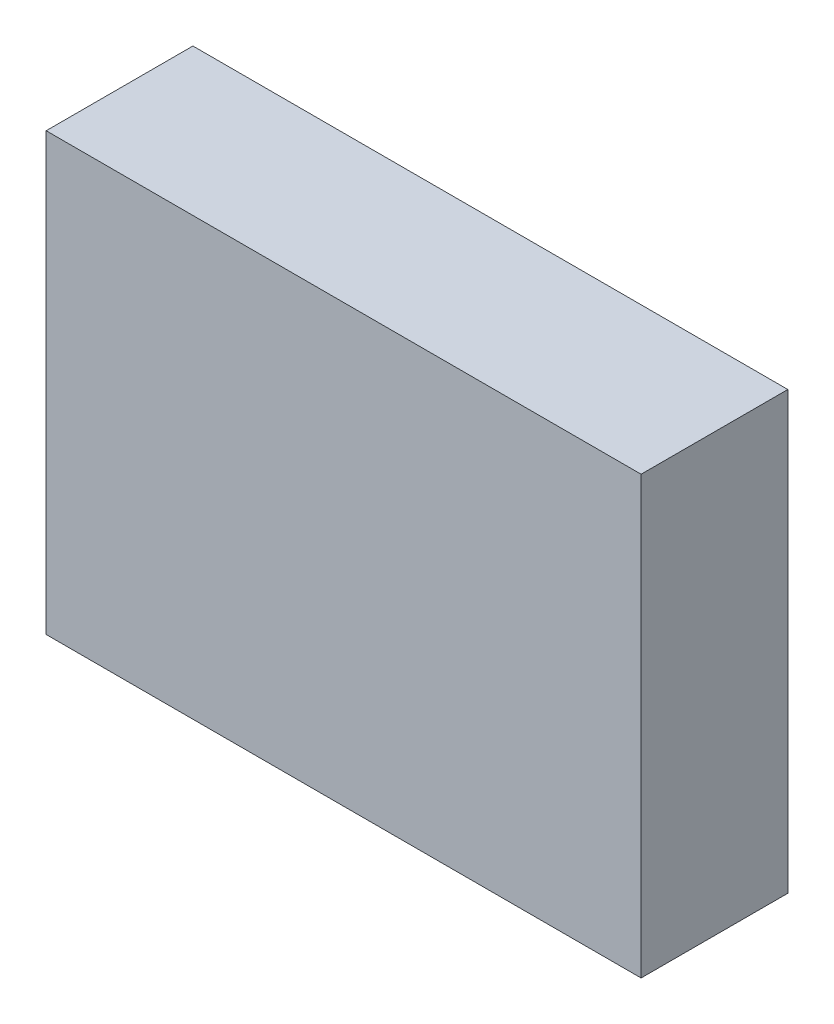
ISO-10303-21;
HEADER;
FILE_DESCRIPTION(('STEP AP214'),'2;1');
FILE_NAME('part.step','',(''),(''),'','','');
FILE_SCHEMA(('AUTOMOTIVE_DESIGN { 1 0 10303 214 1 1 1 1 }'));
ENDSEC;
DATA;
#1=APPLICATION_CONTEXT('core data for automotive mechanical design processes');
#2=APPLICATION_PROTOCOL_DEFINITION('international standard','automotive_design',2000,#1);
#3=PRODUCT_CONTEXT('',#1,'mechanical');
#4=PRODUCT('Part','Part','',(#3));
#5=PRODUCT_RELATED_PRODUCT_CATEGORY('part','',(#4));
#6=PRODUCT_DEFINITION_FORMATION('','',#4);
#7=PRODUCT_DEFINITION_CONTEXT('part definition',#1,'design');
#8=PRODUCT_DEFINITION('design','',#6,#7);
#9=PRODUCT_DEFINITION_SHAPE('','',#8);
#10=(LENGTH_UNIT() NAMED_UNIT(*) SI_UNIT(.MILLI.,.METRE.));
#11=(NAMED_UNIT(*) PLANE_ANGLE_UNIT() SI_UNIT($,.RADIAN.));
#12=(NAMED_UNIT(*) SI_UNIT($,.STERADIAN.) SOLID_ANGLE_UNIT());
#13=UNCERTAINTY_MEASURE_WITH_UNIT(LENGTH_MEASURE(1.E-05),#10,'distance_accuracy_value','');
#14=(GEOMETRIC_REPRESENTATION_CONTEXT(3) GLOBAL_UNCERTAINTY_ASSIGNED_CONTEXT((#13)) GLOBAL_UNIT_ASSIGNED_CONTEXT((#10,
#11,#12)) REPRESENTATION_CONTEXT('',''));
#15=CARTESIAN_POINT('',(0.,0.,0.));
#16=DIRECTION('',(0.,0.,1.));
#17=DIRECTION('',(1.,0.,0.));
#18=AXIS2_PLACEMENT_3D('',#15,#16,#17);
#19=CARTESIAN_POINT('',(0.,1.27000001273E-06,0.36999926));
#20=DIRECTION('',(0.,0.,1.));
#21=DIRECTION('',(1.,0.,0.));
#22=AXIS2_PLACEMENT_3D('',#19,#20,#21);
#23=PLANE('',#22);
#24=DIRECTION('',(0.,1.,0.));
#25=VECTOR('',#24,1.);
#26=CARTESIAN_POINT('',(0.75000104,-0.5499989,0.36999926));
#27=LINE('',#26,#25);
#28=CARTESIAN_POINT('',(0.75000104,-0.5499989,0.36999926));
#29=VERTEX_POINT('',#28);
#30=CARTESIAN_POINT('',(0.75000104,0.55000144,0.36999926));
#31=VERTEX_POINT('',#30);
#32=EDGE_CURVE('E20',#29,#31,#27,.T.);
#33=ORIENTED_EDGE('',*,*,#32,.T.);
#34=DIRECTION('',(-1.,0.,0.));
#35=VECTOR('',#34,1.);
#36=CARTESIAN_POINT('',(0.75000104,0.55000144,0.36999926));
#37=LINE('',#36,#35);
#38=CARTESIAN_POINT('',(-0.75000104,0.55000144,0.36999926));
#39=VERTEX_POINT('',#38);
#40=EDGE_CURVE('E72',#31,#39,#37,.T.);
#41=ORIENTED_EDGE('',*,*,#40,.T.);
#42=DIRECTION('',(0.,-1.,0.));
#43=VECTOR('',#42,1.);
#44=CARTESIAN_POINT('',(-0.75000104,0.55000144,0.36999926));
#45=LINE('',#44,#43);
#46=CARTESIAN_POINT('',(-0.75000104,-0.5499989,0.36999926));
#47=VERTEX_POINT('',#46);
#48=EDGE_CURVE('E108',#39,#47,#45,.T.);
#49=ORIENTED_EDGE('',*,*,#48,.T.);
#50=DIRECTION('',(1.,0.,0.));
#51=VECTOR('',#50,1.);
#52=CARTESIAN_POINT('',(-0.75000104,-0.5499989,0.36999926));
#53=LINE('',#52,#51);
#54=EDGE_CURVE('E11',#47,#29,#53,.T.);
#55=ORIENTED_EDGE('',*,*,#54,.T.);
#56=EDGE_LOOP('',(#33,#41,#49,#55));
#57=FACE_BOUND('',#56,.T.);
#58=ADVANCED_FACE('F16',(#57),#23,.T.);
#59=CARTESIAN_POINT('',(0.,1.27000001273E-06,0.));
#60=DIRECTION('',(0.,0.,1.));
#61=DIRECTION('',(1.,0.,0.));
#62=AXIS2_PLACEMENT_3D('',#59,#60,#61);
#63=PLANE('',#62);
#64=DIRECTION('',(0.,1.,0.));
#65=VECTOR('',#64,1.);
#66=CARTESIAN_POINT('',(0.75000104,-0.5499989,0.));
#67=LINE('',#66,#65);
#68=CARTESIAN_POINT('',(0.75000104,-0.5499989,0.));
#69=VERTEX_POINT('',#68);
#70=CARTESIAN_POINT('',(0.75000104,0.55000144,0.));
#71=VERTEX_POINT('',#70);
#72=EDGE_CURVE('E90',#69,#71,#67,.T.);
#73=ORIENTED_EDGE('',*,*,#72,.F.);
#74=DIRECTION('',(1.,0.,0.));
#75=VECTOR('',#74,1.);
#76=CARTESIAN_POINT('',(-0.75000104,-0.5499989,0.));
#77=LINE('',#76,#75);
#78=CARTESIAN_POINT('',(-0.75000104,-0.5499989,0.));
#79=VERTEX_POINT('',#78);
#80=EDGE_CURVE('E27',#79,#69,#77,.T.);
#81=ORIENTED_EDGE('',*,*,#80,.F.);
#82=DIRECTION('',(0.,-1.,0.));
#83=VECTOR('',#82,1.);
#84=CARTESIAN_POINT('',(-0.75000104,0.55000144,0.));
#85=LINE('',#84,#83);
#86=CARTESIAN_POINT('',(-0.75000104,0.55000144,0.));
#87=VERTEX_POINT('',#86);
#88=EDGE_CURVE('E62',#87,#79,#85,.T.);
#89=ORIENTED_EDGE('',*,*,#88,.F.);
#90=DIRECTION('',(-1.,0.,0.));
#91=VECTOR('',#90,1.);
#92=CARTESIAN_POINT('',(0.75000104,0.55000144,0.));
#93=LINE('',#92,#91);
#94=EDGE_CURVE('E87',#71,#87,#93,.T.);
#95=ORIENTED_EDGE('',*,*,#94,.F.);
#96=EDGE_LOOP('',(#73,#81,#89,#95));
#97=FACE_BOUND('',#96,.T.);
#98=ADVANCED_FACE('F117',(#97),#63,.F.);
#99=CARTESIAN_POINT('',(-0.75000104,-0.5499989,0.));
#100=DIRECTION('',(0.,1.,0.));
#101=DIRECTION('',(1.,0.,0.));
#102=AXIS2_PLACEMENT_3D('',#99,#100,#101);
#103=PLANE('',#102);
#104=DIRECTION('',(0.,0.,1.));
#105=VECTOR('',#104,1.);
#106=CARTESIAN_POINT('',(-0.75000104,-0.5499989,0.));
#107=LINE('',#106,#105);
#108=EDGE_CURVE('E104',#79,#47,#107,.T.);
#109=ORIENTED_EDGE('',*,*,#108,.F.);
#110=ORIENTED_EDGE('',*,*,#80,.T.);
#111=DIRECTION('',(0.,0.,1.));
#112=VECTOR('',#111,1.);
#113=CARTESIAN_POINT('',(0.75000104,-0.5499989,0.));
#114=LINE('',#113,#112);
#115=EDGE_CURVE('E97',#69,#29,#114,.T.);
#116=ORIENTED_EDGE('',*,*,#115,.T.);
#117=ORIENTED_EDGE('',*,*,#54,.F.);
#118=EDGE_LOOP('',(#109,#110,#116,#117));
#119=FACE_BOUND('',#118,.T.);
#120=ADVANCED_FACE('F18',(#119),#103,.F.);
#121=CARTESIAN_POINT('',(-0.75000104,0.55000144,0.));
#122=DIRECTION('',(1.,0.,0.));
#123=DIRECTION('',(0.,1.,0.));
#124=AXIS2_PLACEMENT_3D('',#121,#122,#123);
#125=PLANE('',#124);
#126=DIRECTION('',(0.,0.,1.));
#127=VECTOR('',#126,1.);
#128=CARTESIAN_POINT('',(-0.75000104,0.55000144,0.));
#129=LINE('',#128,#127);
#130=EDGE_CURVE('E79',#87,#39,#129,.T.);
#131=ORIENTED_EDGE('',*,*,#130,.F.);
#132=ORIENTED_EDGE('',*,*,#88,.T.);
#133=ORIENTED_EDGE('',*,*,#108,.T.);
#134=ORIENTED_EDGE('',*,*,#48,.F.);
#135=EDGE_LOOP('',(#131,#132,#133,#134));
#136=FACE_BOUND('',#135,.T.);
#137=ADVANCED_FACE('F129',(#136),#125,.F.);
#138=CARTESIAN_POINT('',(0.75000104,0.55000144,0.));
#139=DIRECTION('',(0.,-1.,0.));
#140=DIRECTION('',(0.,0.,-1.));
#141=AXIS2_PLACEMENT_3D('',#138,#139,#140);
#142=PLANE('',#141);
#143=DIRECTION('',(0.,0.,1.));
#144=VECTOR('',#143,1.);
#145=CARTESIAN_POINT('',(0.75000104,0.55000144,0.));
#146=LINE('',#145,#144);
#147=EDGE_CURVE('E77',#71,#31,#146,.T.);
#148=ORIENTED_EDGE('',*,*,#147,.F.);
#149=ORIENTED_EDGE('',*,*,#94,.T.);
#150=ORIENTED_EDGE('',*,*,#130,.T.);
#151=ORIENTED_EDGE('',*,*,#40,.F.);
#152=EDGE_LOOP('',(#148,#149,#150,#151));
#153=FACE_BOUND('',#152,.T.);
#154=ADVANCED_FACE('F74',(#153),#142,.F.);
#155=CARTESIAN_POINT('',(0.75000104,-0.5499989,0.));
#156=DIRECTION('',(-1.,0.,0.));
#157=DIRECTION('',(0.,0.,1.));
#158=AXIS2_PLACEMENT_3D('',#155,#156,#157);
#159=PLANE('',#158);
#160=ORIENTED_EDGE('',*,*,#115,.F.);
#161=ORIENTED_EDGE('',*,*,#72,.T.);
#162=ORIENTED_EDGE('',*,*,#147,.T.);
#163=ORIENTED_EDGE('',*,*,#32,.F.);
#164=EDGE_LOOP('',(#160,#161,#162,#163));
#165=FACE_BOUND('',#164,.T.);
#166=ADVANCED_FACE('F88',(#165),#159,.F.);
#167=CLOSED_SHELL('',(#58,#98,#120,#137,#154,#166));
#168=MANIFOLD_SOLID_BREP('B1',#167);
#169=ADVANCED_BREP_SHAPE_REPRESENTATION('',(#18,#168),#14);
#170=SHAPE_DEFINITION_REPRESENTATION(#9,#169);
ENDSEC;
END-ISO-10303-21;
